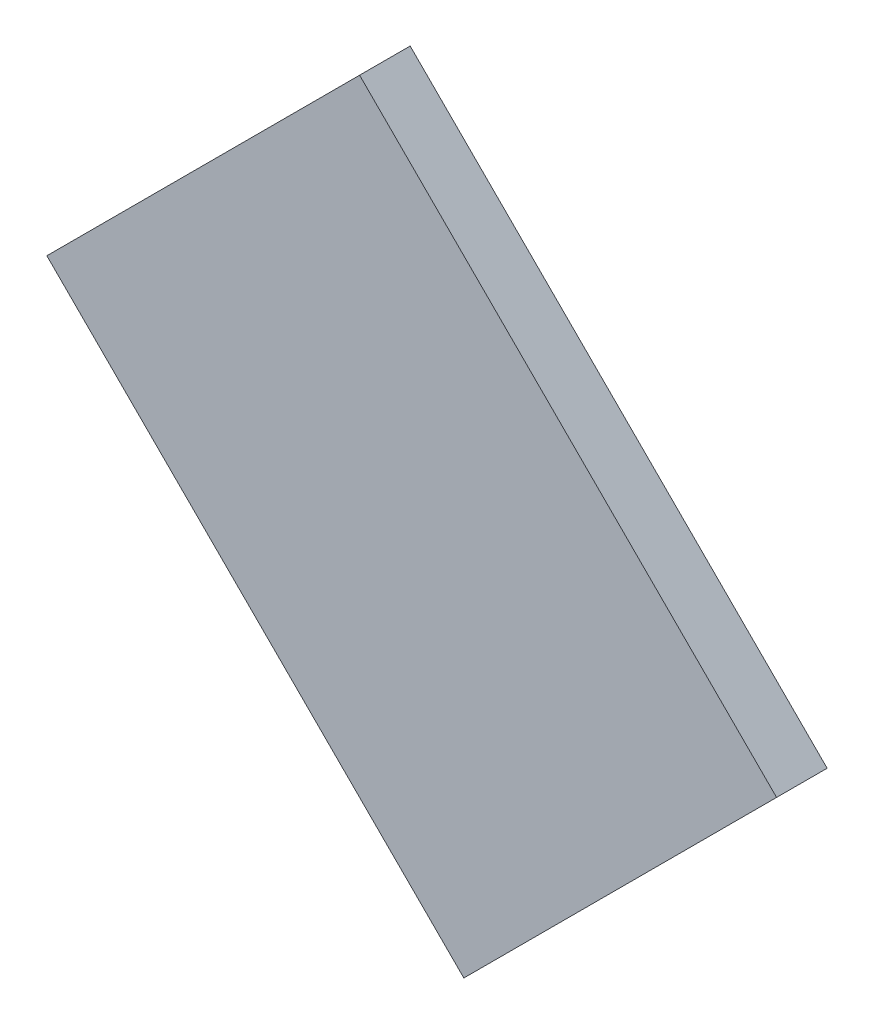
ISO-10303-21;
HEADER;
FILE_DESCRIPTION(('STEP AP214'),'2;1');
FILE_NAME('part.step','',(''),(''),'','','');
FILE_SCHEMA(('AUTOMOTIVE_DESIGN { 1 0 10303 214 1 1 1 1 }'));
ENDSEC;
DATA;
#1=APPLICATION_CONTEXT('core data for automotive mechanical design processes');
#2=APPLICATION_PROTOCOL_DEFINITION('international standard','automotive_design',2000,#1);
#3=PRODUCT_CONTEXT('',#1,'mechanical');
#4=PRODUCT('Part','Part','',(#3));
#5=PRODUCT_RELATED_PRODUCT_CATEGORY('part','',(#4));
#6=PRODUCT_DEFINITION_FORMATION('','',#4);
#7=PRODUCT_DEFINITION_CONTEXT('part definition',#1,'design');
#8=PRODUCT_DEFINITION('design','',#6,#7);
#9=PRODUCT_DEFINITION_SHAPE('','',#8);
#10=(LENGTH_UNIT() NAMED_UNIT(*) SI_UNIT(.MILLI.,.METRE.));
#11=(NAMED_UNIT(*) PLANE_ANGLE_UNIT() SI_UNIT($,.RADIAN.));
#12=(NAMED_UNIT(*) SI_UNIT($,.STERADIAN.) SOLID_ANGLE_UNIT());
#13=UNCERTAINTY_MEASURE_WITH_UNIT(LENGTH_MEASURE(1.E-05),#10,'distance_accuracy_value','');
#14=(GEOMETRIC_REPRESENTATION_CONTEXT(3) GLOBAL_UNCERTAINTY_ASSIGNED_CONTEXT((#13)) GLOBAL_UNIT_ASSIGNED_CONTEXT((#10,
#11,#12)) REPRESENTATION_CONTEXT('',''));
#15=CARTESIAN_POINT('',(0.,0.,0.));
#16=DIRECTION('',(0.,0.,1.));
#17=DIRECTION('',(1.,0.,0.));
#18=AXIS2_PLACEMENT_3D('',#15,#16,#17);
#19=CARTESIAN_POINT('',(8.6744546665,9.5974546665,0.76487));
#20=DIRECTION('',(0.,0.,-1.));
#21=DIRECTION('',(-1.,0.,0.));
#22=AXIS2_PLACEMENT_3D('',#19,#20,#21);
#23=PLANE('',#22);
#24=DIRECTION('',(0.707106781186548,0.707106781186548,0.));
#25=VECTOR('',#24,1.);
#26=CARTESIAN_POINT('',(8.426967333,9.63281,0.76487));
#27=LINE('',#26,#25);
#28=CARTESIAN_POINT('',(8.426967333,9.63281,0.76487));
#29=VERTEX_POINT('',#28);
#30=CARTESIAN_POINT('',(8.639099333,9.844942,0.76487));
#31=VERTEX_POINT('',#30);
#32=EDGE_CURVE('E55',#29,#31,#27,.T.);
#33=ORIENTED_EDGE('',*,*,#32,.T.);
#34=DIRECTION('',(0.707106781186548,-0.707106781186548,0.));
#35=VECTOR('',#34,1.);
#36=CARTESIAN_POINT('',(8.639099333,9.844942,0.76487));
#37=LINE('',#36,#35);
#38=CARTESIAN_POINT('',(8.921942,9.562099333,0.76487));
#39=VERTEX_POINT('',#38);
#40=EDGE_CURVE('E57',#31,#39,#37,.T.);
#41=ORIENTED_EDGE('',*,*,#40,.T.);
#42=DIRECTION('',(-0.707106781186548,-0.707106781186548,0.));
#43=VECTOR('',#42,1.);
#44=CARTESIAN_POINT('',(8.921942,9.562099333,0.76487));
#45=LINE('',#44,#43);
#46=CARTESIAN_POINT('',(8.70981,9.349967333,0.76487));
#47=VERTEX_POINT('',#46);
#48=EDGE_CURVE('E20',#39,#47,#45,.T.);
#49=ORIENTED_EDGE('',*,*,#48,.T.);
#50=DIRECTION('',(-0.707106781186548,0.707106781186548,0.));
#51=VECTOR('',#50,1.);
#52=CARTESIAN_POINT('',(8.70981,9.349967333,0.76487));
#53=LINE('',#52,#51);
#54=EDGE_CURVE('E80',#47,#29,#53,.T.);
#55=ORIENTED_EDGE('',*,*,#54,.T.);
#56=EDGE_LOOP('',(#33,#41,#49,#55));
#57=FACE_BOUND('',#56,.T.);
#58=ADVANCED_FACE('F17',(#57),#23,.T.);
#59=CARTESIAN_POINT('',(8.921942,9.562099333,0.76487));
#60=DIRECTION('',(-0.707106781186548,0.707106781186548,0.));
#61=DIRECTION('',(-0.707106781186548,-0.707106781186548,0.));
#62=AXIS2_PLACEMENT_3D('',#59,#60,#61);
#63=PLANE('',#62);
#64=DIRECTION('',(0.,0.,1.));
#65=VECTOR('',#64,1.);
#66=CARTESIAN_POINT('',(8.70981,9.349967333,0.76487));
#67=LINE('',#66,#65);
#68=CARTESIAN_POINT('',(8.70981,9.349967333,0.79916));
#69=VERTEX_POINT('',#68);
#70=EDGE_CURVE('E68',#69,#47,#67,.F.);
#71=ORIENTED_EDGE('',*,*,#70,.T.);
#72=ORIENTED_EDGE('',*,*,#48,.F.);
#73=DIRECTION('',(0.,0.,1.));
#74=VECTOR('',#73,1.);
#75=CARTESIAN_POINT('',(8.921942,9.562099333,0.76487));
#76=LINE('',#75,#74);
#77=CARTESIAN_POINT('',(8.921942,9.562099333,0.79916));
#78=VERTEX_POINT('',#77);
#79=EDGE_CURVE('E63',#39,#78,#76,.T.);
#80=ORIENTED_EDGE('',*,*,#79,.T.);
#81=DIRECTION('',(0.707106781186545,0.70710678118655,0.));
#82=VECTOR('',#81,1.);
#83=CARTESIAN_POINT('',(8.70981,9.349967333,0.79916));
#84=LINE('',#83,#82);
#85=EDGE_CURVE('E83',#69,#78,#84,.T.);
#86=ORIENTED_EDGE('',*,*,#85,.F.);
#87=EDGE_LOOP('',(#71,#72,#80,#86));
#88=FACE_BOUND('',#87,.T.);
#89=ADVANCED_FACE('F65',(#88),#63,.F.);
#90=CARTESIAN_POINT('',(8.639099333,9.844942,0.76487));
#91=DIRECTION('',(-0.707106781186548,-0.707106781186548,0.));
#92=DIRECTION('',(0.707106781186548,-0.707106781186548,0.));
#93=AXIS2_PLACEMENT_3D('',#90,#91,#92);
#94=PLANE('',#93);
#95=ORIENTED_EDGE('',*,*,#79,.F.);
#96=ORIENTED_EDGE('',*,*,#40,.F.);
#97=DIRECTION('',(0.,0.,1.));
#98=VECTOR('',#97,1.);
#99=CARTESIAN_POINT('',(8.639099333,9.844942,0.76487));
#100=LINE('',#99,#98);
#101=CARTESIAN_POINT('',(8.639099333,9.844942,0.79916));
#102=VERTEX_POINT('',#101);
#103=EDGE_CURVE('E75',#31,#102,#100,.T.);
#104=ORIENTED_EDGE('',*,*,#103,.T.);
#105=DIRECTION('',(-0.707106781186548,0.707106781186548,0.));
#106=VECTOR('',#105,1.);
#107=CARTESIAN_POINT('',(8.921942,9.562099333,0.79916));
#108=LINE('',#107,#106);
#109=EDGE_CURVE('E72',#78,#102,#108,.T.);
#110=ORIENTED_EDGE('',*,*,#109,.F.);
#111=EDGE_LOOP('',(#95,#96,#104,#110));
#112=FACE_BOUND('',#111,.T.);
#113=ADVANCED_FACE('F70',(#112),#94,.F.);
#114=CARTESIAN_POINT('',(8.426967333,9.63281,0.76487));
#115=DIRECTION('',(0.707106781186548,-0.707106781186548,0.));
#116=DIRECTION('',(0.707106781186548,0.707106781186548,0.));
#117=AXIS2_PLACEMENT_3D('',#114,#115,#116);
#118=PLANE('',#117);
#119=ORIENTED_EDGE('',*,*,#103,.F.);
#120=ORIENTED_EDGE('',*,*,#32,.F.);
#121=DIRECTION('',(0.,0.,1.));
#122=VECTOR('',#121,1.);
#123=CARTESIAN_POINT('',(8.426967333,9.63281,0.76487));
#124=LINE('',#123,#122);
#125=CARTESIAN_POINT('',(8.426967333,9.63281,0.79916));
#126=VERTEX_POINT('',#125);
#127=EDGE_CURVE('E35',#29,#126,#124,.T.);
#128=ORIENTED_EDGE('',*,*,#127,.T.);
#129=DIRECTION('',(-0.707106781186545,-0.70710678118655,0.));
#130=VECTOR('',#129,1.);
#131=CARTESIAN_POINT('',(8.639099333,9.844942,0.79916));
#132=LINE('',#131,#130);
#133=EDGE_CURVE('E26',#102,#126,#132,.T.);
#134=ORIENTED_EDGE('',*,*,#133,.F.);
#135=EDGE_LOOP('',(#119,#120,#128,#134));
#136=FACE_BOUND('',#135,.T.);
#137=ADVANCED_FACE('F89',(#136),#118,.F.);
#138=CARTESIAN_POINT('',(8.70981,9.349967333,0.76487));
#139=DIRECTION('',(0.707106781186548,0.707106781186548,0.));
#140=DIRECTION('',(-0.707106781186548,0.707106781186548,0.));
#141=AXIS2_PLACEMENT_3D('',#138,#139,#140);
#142=PLANE('',#141);
#143=ORIENTED_EDGE('',*,*,#127,.F.);
#144=ORIENTED_EDGE('',*,*,#54,.F.);
#145=ORIENTED_EDGE('',*,*,#70,.F.);
#146=DIRECTION('',(0.707106781186548,-0.707106781186548,0.));
#147=VECTOR('',#146,1.);
#148=CARTESIAN_POINT('',(8.426967333,9.63281,0.79916));
#149=LINE('',#148,#147);
#150=EDGE_CURVE('E11',#126,#69,#149,.T.);
#151=ORIENTED_EDGE('',*,*,#150,.F.);
#152=EDGE_LOOP('',(#143,#144,#145,#151));
#153=FACE_BOUND('',#152,.T.);
#154=ADVANCED_FACE('F91',(#153),#142,.F.);
#155=CARTESIAN_POINT('',(8.6744546665,9.5974546665,0.79916));
#156=DIRECTION('',(0.,0.,1.));
#157=DIRECTION('',(0.,-1.,0.));
#158=AXIS2_PLACEMENT_3D('',#155,#156,#157);
#159=PLANE('',#158);
#160=ORIENTED_EDGE('',*,*,#133,.T.);
#161=ORIENTED_EDGE('',*,*,#150,.T.);
#162=ORIENTED_EDGE('',*,*,#85,.T.);
#163=ORIENTED_EDGE('',*,*,#109,.T.);
#164=EDGE_LOOP('',(#160,#161,#162,#163));
#165=FACE_BOUND('',#164,.T.);
#166=ADVANCED_FACE('F88',(#165),#159,.T.);
#167=CLOSED_SHELL('',(#58,#89,#113,#137,#154,#166));
#168=MANIFOLD_SOLID_BREP('B1',#167);
#169=ADVANCED_BREP_SHAPE_REPRESENTATION('',(#18,#168),#14);
#170=SHAPE_DEFINITION_REPRESENTATION(#9,#169);
ENDSEC;
END-ISO-10303-21;
